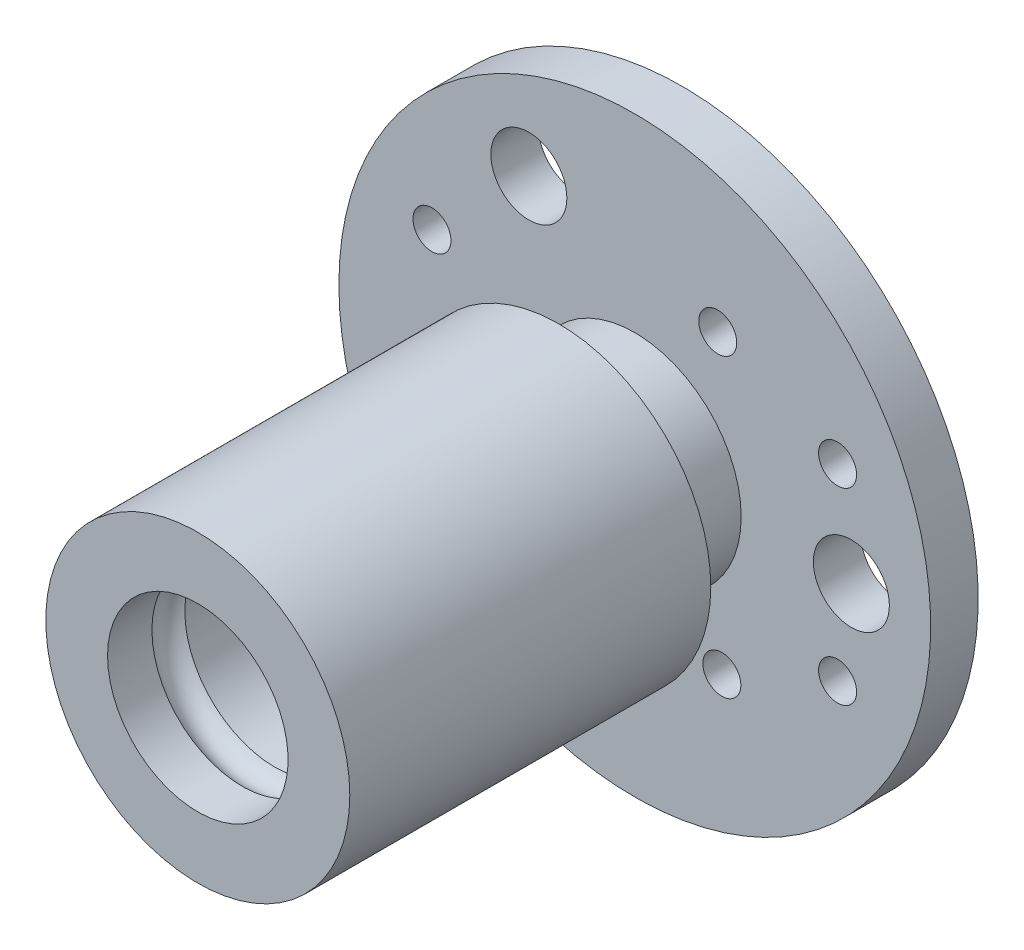
ISO-10303-21;
HEADER;
FILE_DESCRIPTION(('STEP AP214'),'2;1');
FILE_NAME('part.step','',(''),(''),'','','');
FILE_SCHEMA(('AUTOMOTIVE_DESIGN { 1 0 10303 214 1 1 1 1 }'));
ENDSEC;
DATA;
#1=APPLICATION_CONTEXT('core data for automotive mechanical design processes');
#2=APPLICATION_PROTOCOL_DEFINITION('international standard','automotive_design',2000,#1);
#3=PRODUCT_CONTEXT('',#1,'mechanical');
#4=PRODUCT('Part','Part','',(#3));
#5=PRODUCT_RELATED_PRODUCT_CATEGORY('part','',(#4));
#6=PRODUCT_DEFINITION_FORMATION('','',#4);
#7=PRODUCT_DEFINITION_CONTEXT('part definition',#1,'design');
#8=PRODUCT_DEFINITION('design','',#6,#7);
#9=PRODUCT_DEFINITION_SHAPE('','',#8);
#10=(LENGTH_UNIT() NAMED_UNIT(*) SI_UNIT(.MILLI.,.METRE.));
#11=(NAMED_UNIT(*) PLANE_ANGLE_UNIT() SI_UNIT($,.RADIAN.));
#12=(NAMED_UNIT(*) SI_UNIT($,.STERADIAN.) SOLID_ANGLE_UNIT());
#13=UNCERTAINTY_MEASURE_WITH_UNIT(LENGTH_MEASURE(1.E-05),#10,'distance_accuracy_value','');
#14=(GEOMETRIC_REPRESENTATION_CONTEXT(3) GLOBAL_UNCERTAINTY_ASSIGNED_CONTEXT((#13)) GLOBAL_UNIT_ASSIGNED_CONTEXT((#10,
#11,#12)) REPRESENTATION_CONTEXT('',''));
#15=CARTESIAN_POINT('',(0.,0.,0.));
#16=DIRECTION('',(0.,0.,1.));
#17=DIRECTION('',(1.,0.,0.));
#18=AXIS2_PLACEMENT_3D('',#15,#16,#17);
#19=CARTESIAN_POINT('',(0.,0.,51.));
#20=DIRECTION('',(0.,0.,-1.));
#21=DIRECTION('',(-1.,0.,0.));
#22=AXIS2_PLACEMENT_3D('',#19,#20,#21);
#23=CYLINDRICAL_SURFACE('',#22,9.5);
#24=CARTESIAN_POINT('',(0.,0.,42.8679491924311));
#25=DIRECTION('',(0.,0.,1.));
#26=DIRECTION('',(1.,0.,0.));
#27=AXIS2_PLACEMENT_3D('',#24,#25,#26);
#28=CIRCLE('',#27,9.5);
#29=CARTESIAN_POINT('',(9.50000000000001,0.,42.8679491924311));
#30=VERTEX_POINT('',#29);
#31=EDGE_CURVE('E36',#30,#30,#28,.T.);
#32=ORIENTED_EDGE('',*,*,#31,.T.);
#33=EDGE_LOOP('',(#32));
#34=FACE_BOUND('',#33,.T.);
#35=CARTESIAN_POINT('',(0.,0.,0.));
#36=DIRECTION('',(0.,0.,-1.));
#37=DIRECTION('',(-1.,0.,0.));
#38=AXIS2_PLACEMENT_3D('',#35,#36,#37);
#39=CIRCLE('',#38,9.5);
#40=CARTESIAN_POINT('',(-9.5,0.,0.));
#41=VERTEX_POINT('',#40);
#42=EDGE_CURVE('E112',#41,#41,#39,.T.);
#43=ORIENTED_EDGE('',*,*,#42,.T.);
#44=EDGE_LOOP('',(#43));
#45=FACE_BOUND('',#44,.T.);
#46=ADVANCED_FACE('F32',(#34,#45),#23,.F.);
#47=CARTESIAN_POINT('',(0.,0.,5.));
#48=DIRECTION('',(0.,0.,1.));
#49=DIRECTION('',(1.,0.,0.));
#50=AXIS2_PLACEMENT_3D('',#47,#48,#49);
#51=PLANE('',#50);
#52=CARTESIAN_POINT('',(-11.1500000000002,19.8876334956068,5.));
#53=DIRECTION('',(0.,0.,1.));
#54=DIRECTION('',(1.,0.,0.));
#55=AXIS2_PLACEMENT_3D('',#52,#53,#54);
#56=CIRCLE('',#55,4.);
#57=CARTESIAN_POINT('',(-7.15000000000023,19.8876334956068,5.));
#58=VERTEX_POINT('',#57);
#59=EDGE_CURVE('E63',#58,#58,#56,.T.);
#60=ORIENTED_EDGE('',*,*,#59,.F.);
#61=EDGE_LOOP('',(#60));
#62=FACE_BOUND('',#61,.T.);
#63=CARTESIAN_POINT('',(22.79819582835,-0.287633495606848,5.));
#64=DIRECTION('',(0.,0.,1.));
#65=DIRECTION('',(1.,0.,0.));
#66=AXIS2_PLACEMENT_3D('',#63,#64,#65);
#67=CIRCLE('',#66,4.);
#68=CARTESIAN_POINT('',(26.79819582835,-0.287633495606848,5.));
#69=VERTEX_POINT('',#68);
#70=EDGE_CURVE('E52',#69,#69,#67,.T.);
#71=ORIENTED_EDGE('',*,*,#70,.F.);
#72=EDGE_LOOP('',(#71));
#73=FACE_BOUND('',#72,.T.);
#74=CARTESIAN_POINT('',(-11.6481958283499,-19.6,5.));
#75=DIRECTION('',(0.,0.,1.));
#76=DIRECTION('',(1.,0.,0.));
#77=AXIS2_PLACEMENT_3D('',#74,#75,#76);
#78=CIRCLE('',#77,4.);
#79=CARTESIAN_POINT('',(-7.64819582834992,-19.6,5.));
#80=VERTEX_POINT('',#79);
#81=EDGE_CURVE('E67',#80,#80,#78,.F.);
#82=ORIENTED_EDGE('',*,*,#81,.T.);
#83=EDGE_LOOP('',(#82));
#84=FACE_BOUND('',#83,.T.);
#85=CARTESIAN_POINT('',(-21.35,-9.9,5.));
#86=DIRECTION('',(0.,0.,1.));
#87=DIRECTION('',(1.,0.,0.));
#88=AXIS2_PLACEMENT_3D('',#85,#86,#87);
#89=CIRCLE('',#88,2.);
#90=CARTESIAN_POINT('',(-19.35,-9.9,5.));
#91=VERTEX_POINT('',#90);
#92=EDGE_CURVE('E73',#91,#91,#89,.F.);
#93=ORIENTED_EDGE('',*,*,#92,.T.);
#94=EDGE_LOOP('',(#93));
#95=FACE_BOUND('',#94,.T.);
#96=CARTESIAN_POINT('',(-17.8961271989863,-0.248926919069777,5.));
#97=DIRECTION('',(0.,0.,1.));
#98=DIRECTION('',(1.,0.,0.));
#99=AXIS2_PLACEMENT_3D('',#96,#97,#98);
#100=CIRCLE('',#99,2.);
#101=CARTESIAN_POINT('',(-15.8961271989863,-0.248926919069777,5.));
#102=VERTEX_POINT('',#101);
#103=EDGE_CURVE('E81',#102,#102,#100,.F.);
#104=ORIENTED_EDGE('',*,*,#103,.T.);
#105=EDGE_LOOP('',(#104));
#106=FACE_BOUND('',#105,.T.);
#107=CARTESIAN_POINT('',(-21.35,9.9,5.));
#108=DIRECTION('',(0.,0.,1.));
#109=DIRECTION('',(1.,0.,0.));
#110=AXIS2_PLACEMENT_3D('',#107,#108,#109);
#111=CIRCLE('',#110,2.);
#112=CARTESIAN_POINT('',(-19.35,9.9,5.));
#113=VERTEX_POINT('',#112);
#114=EDGE_CURVE('E85',#113,#113,#111,.F.);
#115=ORIENTED_EDGE('',*,*,#114,.T.);
#116=EDGE_LOOP('',(#115));
#117=FACE_BOUND('',#116,.T.);
#118=CARTESIAN_POINT('',(8.73248656389291,15.6229642432146,5.));
#119=DIRECTION('',(0.,0.,1.));
#120=DIRECTION('',(1.,0.,0.));
#121=AXIS2_PLACEMENT_3D('',#118,#119,#120);
#122=CIRCLE('',#121,2.);
#123=CARTESIAN_POINT('',(10.7324865638929,15.6229642432146,5.));
#124=VERTEX_POINT('',#123);
#125=EDGE_CURVE('E93',#124,#124,#122,.F.);
#126=ORIENTED_EDGE('',*,*,#125,.T.);
#127=EDGE_LOOP('',(#126));
#128=FACE_BOUND('',#127,.T.);
#129=CARTESIAN_POINT('',(9.16364063509336,-15.3740373241449,5.));
#130=DIRECTION('',(0.,0.,1.));
#131=DIRECTION('',(1.,0.,0.));
#132=AXIS2_PLACEMENT_3D('',#129,#130,#131);
#133=CIRCLE('',#132,2.);
#134=CARTESIAN_POINT('',(11.1636406350934,-15.3740373241449,5.));
#135=VERTEX_POINT('',#134);
#136=EDGE_CURVE('E99',#135,#135,#133,.F.);
#137=ORIENTED_EDGE('',*,*,#136,.T.);
#138=EDGE_LOOP('',(#137));
#139=FACE_BOUND('',#138,.T.);
#140=CARTESIAN_POINT('',(21.35,-9.90000000000001,5.));
#141=DIRECTION('',(0.,0.,1.));
#142=DIRECTION('',(1.,0.,0.));
#143=AXIS2_PLACEMENT_3D('',#140,#141,#142);
#144=CIRCLE('',#143,2.);
#145=CARTESIAN_POINT('',(23.35,-9.90000000000001,5.));
#146=VERTEX_POINT('',#145);
#147=EDGE_CURVE('E103',#146,#146,#144,.F.);
#148=ORIENTED_EDGE('',*,*,#147,.T.);
#149=EDGE_LOOP('',(#148));
#150=FACE_BOUND('',#149,.T.);
#151=CARTESIAN_POINT('',(21.35,9.9,5.));
#152=DIRECTION('',(0.,0.,1.));
#153=DIRECTION('',(1.,0.,0.));
#154=AXIS2_PLACEMENT_3D('',#151,#152,#153);
#155=CIRCLE('',#154,2.);
#156=CARTESIAN_POINT('',(23.35,9.9,5.));
#157=VERTEX_POINT('',#156);
#158=EDGE_CURVE('E106',#157,#157,#155,.F.);
#159=ORIENTED_EDGE('',*,*,#158,.T.);
#160=EDGE_LOOP('',(#159));
#161=FACE_BOUND('',#160,.T.);
#162=CARTESIAN_POINT('',(0.,0.,5.00000000000002));
#163=DIRECTION('',(0.,0.,-1.));
#164=DIRECTION('',(-1.,0.,0.));
#165=AXIS2_PLACEMENT_3D('',#162,#163,#164);
#166=CIRCLE('',#165,31.15);
#167=CARTESIAN_POINT('',(-31.15,0.,5.00000000000002));
#168=VERTEX_POINT('',#167);
#169=EDGE_CURVE('E308',#168,#168,#166,.F.);
#170=ORIENTED_EDGE('',*,*,#169,.T.);
#171=EDGE_LOOP('',(#170));
#172=FACE_BOUND('',#171,.T.);
#173=CARTESIAN_POINT('',(0.,0.,5.));
#174=DIRECTION('',(0.,0.,1.));
#175=DIRECTION('',(1.,0.,0.));
#176=AXIS2_PLACEMENT_3D('',#173,#174,#175);
#177=CIRCLE('',#176,11.2);
#178=CARTESIAN_POINT('',(11.2,0.,5.));
#179=VERTEX_POINT('',#178);
#180=EDGE_CURVE('E40',#179,#179,#177,.T.);
#181=ORIENTED_EDGE('',*,*,#180,.F.);
#182=EDGE_LOOP('',(#181));
#183=FACE_BOUND('',#182,.T.);
#184=ADVANCED_FACE('F142',(#62,#73,#84,#95,#106,#117,#128,#139,#150,#161,#172,#183),#51,.T.);
#185=CARTESIAN_POINT('',(0.,0.,0.));
#186=DIRECTION('',(0.,0.,1.));
#187=DIRECTION('',(1.,0.,0.));
#188=AXIS2_PLACEMENT_3D('',#185,#186,#187);
#189=PLANE('',#188);
#190=CARTESIAN_POINT('',(-11.1500000000002,19.8876334956068,0.));
#191=DIRECTION('',(0.,0.,-1.));
#192=DIRECTION('',(-1.,0.,0.));
#193=AXIS2_PLACEMENT_3D('',#190,#191,#192);
#194=CIRCLE('',#193,4.);
#195=CARTESIAN_POINT('',(-15.1500000000002,19.8876334956068,0.));
#196=VERTEX_POINT('',#195);
#197=EDGE_CURVE('E314',#196,#196,#194,.T.);
#198=ORIENTED_EDGE('',*,*,#197,.F.);
#199=EDGE_LOOP('',(#198));
#200=FACE_BOUND('',#199,.T.);
#201=CARTESIAN_POINT('',(22.79819582835,-0.287633495606848,0.));
#202=DIRECTION('',(0.,0.,-1.));
#203=DIRECTION('',(-1.,0.,0.));
#204=AXIS2_PLACEMENT_3D('',#201,#202,#203);
#205=CIRCLE('',#204,4.);
#206=CARTESIAN_POINT('',(18.79819582835,-0.287633495606848,0.));
#207=VERTEX_POINT('',#206);
#208=EDGE_CURVE('E58',#207,#207,#205,.T.);
#209=ORIENTED_EDGE('',*,*,#208,.F.);
#210=EDGE_LOOP('',(#209));
#211=FACE_BOUND('',#210,.T.);
#212=CARTESIAN_POINT('',(-11.6481958283499,-19.6,0.));
#213=DIRECTION('',(0.,0.,-1.));
#214=DIRECTION('',(-1.,0.,0.));
#215=AXIS2_PLACEMENT_3D('',#212,#213,#214);
#216=CIRCLE('',#215,4.);
#217=CARTESIAN_POINT('',(-15.6481958283499,-19.6,0.));
#218=VERTEX_POINT('',#217);
#219=EDGE_CURVE('E56',#218,#218,#216,.T.);
#220=ORIENTED_EDGE('',*,*,#219,.F.);
#221=EDGE_LOOP('',(#220));
#222=FACE_BOUND('',#221,.T.);
#223=CARTESIAN_POINT('',(-21.35,-9.9,0.));
#224=DIRECTION('',(0.,0.,-1.));
#225=DIRECTION('',(-1.,0.,0.));
#226=AXIS2_PLACEMENT_3D('',#223,#224,#225);
#227=CIRCLE('',#226,2.);
#228=CARTESIAN_POINT('',(-23.35,-9.9,0.));
#229=VERTEX_POINT('',#228);
#230=EDGE_CURVE('E70',#229,#229,#227,.T.);
#231=ORIENTED_EDGE('',*,*,#230,.F.);
#232=EDGE_LOOP('',(#231));
#233=FACE_BOUND('',#232,.T.);
#234=CARTESIAN_POINT('',(-17.8961271989863,-0.248926919069777,0.));
#235=DIRECTION('',(0.,0.,-1.));
#236=DIRECTION('',(-1.,0.,0.));
#237=AXIS2_PLACEMENT_3D('',#234,#235,#236);
#238=CIRCLE('',#237,2.);
#239=CARTESIAN_POINT('',(-19.8961271989863,-0.248926919069777,0.));
#240=VERTEX_POINT('',#239);
#241=EDGE_CURVE('E76',#240,#240,#238,.T.);
#242=ORIENTED_EDGE('',*,*,#241,.F.);
#243=EDGE_LOOP('',(#242));
#244=FACE_BOUND('',#243,.T.);
#245=CARTESIAN_POINT('',(-21.35,9.9,0.));
#246=DIRECTION('',(0.,0.,-1.));
#247=DIRECTION('',(-1.,0.,0.));
#248=AXIS2_PLACEMENT_3D('',#245,#246,#247);
#249=CIRCLE('',#248,2.);
#250=CARTESIAN_POINT('',(-23.35,9.9,0.));
#251=VERTEX_POINT('',#250);
#252=EDGE_CURVE('E84',#251,#251,#249,.T.);
#253=ORIENTED_EDGE('',*,*,#252,.F.);
#254=EDGE_LOOP('',(#253));
#255=FACE_BOUND('',#254,.T.);
#256=CARTESIAN_POINT('',(8.73248656389291,15.6229642432146,0.));
#257=DIRECTION('',(0.,0.,-1.));
#258=DIRECTION('',(-1.,0.,0.));
#259=AXIS2_PLACEMENT_3D('',#256,#257,#258);
#260=CIRCLE('',#259,2.);
#261=CARTESIAN_POINT('',(6.73248656389291,15.6229642432146,0.));
#262=VERTEX_POINT('',#261);
#263=EDGE_CURVE('E88',#262,#262,#260,.T.);
#264=ORIENTED_EDGE('',*,*,#263,.F.);
#265=EDGE_LOOP('',(#264));
#266=FACE_BOUND('',#265,.T.);
#267=CARTESIAN_POINT('',(9.16364063509336,-15.3740373241449,0.));
#268=DIRECTION('',(0.,0.,-1.));
#269=DIRECTION('',(-1.,0.,0.));
#270=AXIS2_PLACEMENT_3D('',#267,#268,#269);
#271=CIRCLE('',#270,2.);
#272=CARTESIAN_POINT('',(7.16364063509336,-15.3740373241449,0.));
#273=VERTEX_POINT('',#272);
#274=EDGE_CURVE('E96',#273,#273,#271,.T.);
#275=ORIENTED_EDGE('',*,*,#274,.F.);
#276=EDGE_LOOP('',(#275));
#277=FACE_BOUND('',#276,.T.);
#278=CARTESIAN_POINT('',(21.35,-9.90000000000001,0.));
#279=DIRECTION('',(0.,0.,-1.));
#280=DIRECTION('',(-1.,0.,0.));
#281=AXIS2_PLACEMENT_3D('',#278,#279,#280);
#282=CIRCLE('',#281,2.);
#283=CARTESIAN_POINT('',(19.35,-9.90000000000001,0.));
#284=VERTEX_POINT('',#283);
#285=EDGE_CURVE('E102',#284,#284,#282,.T.);
#286=ORIENTED_EDGE('',*,*,#285,.F.);
#287=EDGE_LOOP('',(#286));
#288=FACE_BOUND('',#287,.T.);
#289=CARTESIAN_POINT('',(21.35,9.9,0.));
#290=DIRECTION('',(0.,0.,-1.));
#291=DIRECTION('',(-1.,0.,0.));
#292=AXIS2_PLACEMENT_3D('',#289,#290,#291);
#293=CIRCLE('',#292,2.);
#294=CARTESIAN_POINT('',(19.35,9.9,0.));
#295=VERTEX_POINT('',#294);
#296=EDGE_CURVE('E109',#295,#295,#293,.T.);
#297=ORIENTED_EDGE('',*,*,#296,.F.);
#298=EDGE_LOOP('',(#297));
#299=FACE_BOUND('',#298,.T.);
#300=ORIENTED_EDGE('',*,*,#42,.F.);
#301=EDGE_LOOP('',(#300));
#302=FACE_BOUND('',#301,.T.);
#303=CARTESIAN_POINT('',(0.,0.,0.));
#304=DIRECTION('',(0.,0.,-1.));
#305=DIRECTION('',(-1.,0.,0.));
#306=AXIS2_PLACEMENT_3D('',#303,#304,#305);
#307=CIRCLE('',#306,31.15);
#308=CARTESIAN_POINT('',(-31.15,0.,0.));
#309=VERTEX_POINT('',#308);
#310=EDGE_CURVE('E311',#309,#309,#307,.T.);
#311=ORIENTED_EDGE('',*,*,#310,.T.);
#312=EDGE_LOOP('',(#311));
#313=FACE_BOUND('',#312,.T.);
#314=ADVANCED_FACE('F34',(#200,#211,#222,#233,#244,#255,#266,#277,#288,#299,#302,#313),#189,.F.);
#315=CARTESIAN_POINT('',(0.,0.,13.));
#316=DIRECTION('',(0.,0.,-1.));
#317=DIRECTION('',(-1.,0.,0.));
#318=AXIS2_PLACEMENT_3D('',#315,#316,#317);
#319=CYLINDRICAL_SURFACE('',#318,11.2);
#320=CARTESIAN_POINT('',(0.,0.,13.));
#321=DIRECTION('',(0.,0.,1.));
#322=DIRECTION('',(1.,0.,0.));
#323=AXIS2_PLACEMENT_3D('',#320,#321,#322);
#324=CIRCLE('',#323,11.2);
#325=CARTESIAN_POINT('',(11.2,0.,13.));
#326=VERTEX_POINT('',#325);
#327=EDGE_CURVE('E11',#326,#326,#324,.T.);
#328=ORIENTED_EDGE('',*,*,#327,.F.);
#329=EDGE_LOOP('',(#328));
#330=FACE_BOUND('',#329,.T.);
#331=ORIENTED_EDGE('',*,*,#180,.T.);
#332=EDGE_LOOP('',(#331));
#333=FACE_BOUND('',#332,.T.);
#334=ADVANCED_FACE('F129',(#330,#333),#319,.T.);
#335=CARTESIAN_POINT('',(0.,0.,13.));
#336=DIRECTION('',(0.,0.,1.));
#337=DIRECTION('',(1.,0.,0.));
#338=AXIS2_PLACEMENT_3D('',#335,#336,#337);
#339=PLANE('',#338);
#340=CARTESIAN_POINT('',(0.,0.,13.));
#341=DIRECTION('',(0.,0.,1.));
#342=DIRECTION('',(1.,0.,0.));
#343=AXIS2_PLACEMENT_3D('',#340,#341,#342);
#344=CIRCLE('',#343,16.);
#345=CARTESIAN_POINT('',(16.,0.,13.));
#346=VERTEX_POINT('',#345);
#347=EDGE_CURVE('E48',#346,#346,#344,.T.);
#348=ORIENTED_EDGE('',*,*,#347,.F.);
#349=EDGE_LOOP('',(#348));
#350=FACE_BOUND('',#349,.T.);
#351=ORIENTED_EDGE('',*,*,#327,.T.);
#352=EDGE_LOOP('',(#351));
#353=FACE_BOUND('',#352,.T.);
#354=ADVANCED_FACE('F127',(#350,#353),#339,.F.);
#355=CARTESIAN_POINT('',(0.,0.,51.));
#356=DIRECTION('',(0.,0.,-1.));
#357=DIRECTION('',(-1.,0.,0.));
#358=AXIS2_PLACEMENT_3D('',#355,#356,#357);
#359=CYLINDRICAL_SURFACE('',#358,16.);
#360=CARTESIAN_POINT('',(0.,0.,51.));
#361=DIRECTION('',(0.,0.,1.));
#362=DIRECTION('',(1.,0.,0.));
#363=AXIS2_PLACEMENT_3D('',#360,#361,#362);
#364=CIRCLE('',#363,16.);
#365=CARTESIAN_POINT('',(16.,0.,51.));
#366=VERTEX_POINT('',#365);
#367=EDGE_CURVE('E45',#366,#366,#364,.T.);
#368=ORIENTED_EDGE('',*,*,#367,.F.);
#369=EDGE_LOOP('',(#368));
#370=FACE_BOUND('',#369,.T.);
#371=ORIENTED_EDGE('',*,*,#347,.T.);
#372=EDGE_LOOP('',(#371));
#373=FACE_BOUND('',#372,.T.);
#374=ADVANCED_FACE('F125',(#370,#373),#359,.T.);
#375=CARTESIAN_POINT('',(0.,0.,51.));
#376=DIRECTION('',(0.,0.,1.));
#377=DIRECTION('',(1.,0.,0.));
#378=AXIS2_PLACEMENT_3D('',#375,#376,#377);
#379=PLANE('',#378);
#380=CARTESIAN_POINT('',(0.,0.,51.));
#381=DIRECTION('',(0.,0.,-1.));
#382=DIRECTION('',(-1.,0.,0.));
#383=AXIS2_PLACEMENT_3D('',#380,#381,#382);
#384=CIRCLE('',#383,9.5);
#385=CARTESIAN_POINT('',(-9.5,0.,51.));
#386=VERTEX_POINT('',#385);
#387=EDGE_CURVE('E115',#386,#386,#384,.T.);
#388=ORIENTED_EDGE('',*,*,#387,.T.);
#389=EDGE_LOOP('',(#388));
#390=FACE_BOUND('',#389,.T.);
#391=ORIENTED_EDGE('',*,*,#367,.T.);
#392=EDGE_LOOP('',(#391));
#393=FACE_BOUND('',#392,.T.);
#394=ADVANCED_FACE('F135',(#390,#393),#379,.T.);
#395=CARTESIAN_POINT('',(0.,0.,46.3320508075689));
#396=DIRECTION('',(0.,0.,-1.));
#397=DIRECTION('',(-1.,0.,0.));
#398=AXIS2_PLACEMENT_3D('',#395,#396,#397);
#399=CIRCLE('',#398,9.5);
#400=CARTESIAN_POINT('',(-9.5,0.,46.3320508075689));
#401=VERTEX_POINT('',#400);
#402=EDGE_CURVE('E50',#401,#401,#399,.T.);
#403=ORIENTED_EDGE('',*,*,#402,.T.);
#404=EDGE_LOOP('',(#403));
#405=FACE_BOUND('',#404,.T.);
#406=ORIENTED_EDGE('',*,*,#387,.F.);
#407=EDGE_LOOP('',(#406));
#408=FACE_BOUND('',#407,.T.);
#409=ADVANCED_FACE('F145',(#405,#408),#23,.F.);
#410=CARTESIAN_POINT('',(21.35,9.9,51.001));
#411=DIRECTION('',(0.,0.,-1.));
#412=DIRECTION('',(-1.,0.,0.));
#413=AXIS2_PLACEMENT_3D('',#410,#411,#412);
#414=CYLINDRICAL_SURFACE('',#413,2.);
#415=ORIENTED_EDGE('',*,*,#158,.F.);
#416=EDGE_LOOP('',(#415));
#417=FACE_BOUND('',#416,.T.);
#418=ORIENTED_EDGE('',*,*,#296,.T.);
#419=EDGE_LOOP('',(#418));
#420=FACE_BOUND('',#419,.T.);
#421=ADVANCED_FACE('F153',(#417,#420),#414,.F.);
#422=CARTESIAN_POINT('',(21.35,-9.90000000000001,51.001));
#423=DIRECTION('',(0.,0.,-1.));
#424=DIRECTION('',(-1.,0.,0.));
#425=AXIS2_PLACEMENT_3D('',#422,#423,#424);
#426=CYLINDRICAL_SURFACE('',#425,2.);
#427=ORIENTED_EDGE('',*,*,#147,.F.);
#428=EDGE_LOOP('',(#427));
#429=FACE_BOUND('',#428,.T.);
#430=ORIENTED_EDGE('',*,*,#285,.T.);
#431=EDGE_LOOP('',(#430));
#432=FACE_BOUND('',#431,.T.);
#433=ADVANCED_FACE('F158',(#429,#432),#426,.F.);
#434=CARTESIAN_POINT('',(9.16364063509336,-15.3740373241449,51.001));
#435=DIRECTION('',(0.,0.,-1.));
#436=DIRECTION('',(-1.,0.,0.));
#437=AXIS2_PLACEMENT_3D('',#434,#435,#436);
#438=CYLINDRICAL_SURFACE('',#437,2.);
#439=ORIENTED_EDGE('',*,*,#136,.F.);
#440=EDGE_LOOP('',(#439));
#441=FACE_BOUND('',#440,.T.);
#442=ORIENTED_EDGE('',*,*,#274,.T.);
#443=EDGE_LOOP('',(#442));
#444=FACE_BOUND('',#443,.T.);
#445=ADVANCED_FACE('F265',(#441,#444),#438,.F.);
#446=CARTESIAN_POINT('',(8.73248656389291,15.6229642432146,51.001));
#447=DIRECTION('',(0.,0.,-1.));
#448=DIRECTION('',(-1.,0.,0.));
#449=AXIS2_PLACEMENT_3D('',#446,#447,#448);
#450=CYLINDRICAL_SURFACE('',#449,2.);
#451=ORIENTED_EDGE('',*,*,#125,.F.);
#452=EDGE_LOOP('',(#451));
#453=FACE_BOUND('',#452,.T.);
#454=ORIENTED_EDGE('',*,*,#263,.T.);
#455=EDGE_LOOP('',(#454));
#456=FACE_BOUND('',#455,.T.);
#457=ADVANCED_FACE('F255',(#453,#456),#450,.F.);
#458=CARTESIAN_POINT('',(-21.35,9.9,51.001));
#459=DIRECTION('',(0.,0.,-1.));
#460=DIRECTION('',(-1.,0.,0.));
#461=AXIS2_PLACEMENT_3D('',#458,#459,#460);
#462=CYLINDRICAL_SURFACE('',#461,2.);
#463=ORIENTED_EDGE('',*,*,#114,.F.);
#464=EDGE_LOOP('',(#463));
#465=FACE_BOUND('',#464,.T.);
#466=ORIENTED_EDGE('',*,*,#252,.T.);
#467=EDGE_LOOP('',(#466));
#468=FACE_BOUND('',#467,.T.);
#469=ADVANCED_FACE('F245',(#465,#468),#462,.F.);
#470=CARTESIAN_POINT('',(-17.8961271989863,-0.248926919069777,51.001));
#471=DIRECTION('',(0.,0.,-1.));
#472=DIRECTION('',(-1.,0.,0.));
#473=AXIS2_PLACEMENT_3D('',#470,#471,#472);
#474=CYLINDRICAL_SURFACE('',#473,2.);
#475=ORIENTED_EDGE('',*,*,#103,.F.);
#476=EDGE_LOOP('',(#475));
#477=FACE_BOUND('',#476,.T.);
#478=ORIENTED_EDGE('',*,*,#241,.T.);
#479=EDGE_LOOP('',(#478));
#480=FACE_BOUND('',#479,.T.);
#481=ADVANCED_FACE('F235',(#477,#480),#474,.F.);
#482=CARTESIAN_POINT('',(-21.35,-9.9,51.001));
#483=DIRECTION('',(0.,0.,-1.));
#484=DIRECTION('',(-1.,0.,0.));
#485=AXIS2_PLACEMENT_3D('',#482,#483,#484);
#486=CYLINDRICAL_SURFACE('',#485,2.);
#487=ORIENTED_EDGE('',*,*,#92,.F.);
#488=EDGE_LOOP('',(#487));
#489=FACE_BOUND('',#488,.T.);
#490=ORIENTED_EDGE('',*,*,#230,.T.);
#491=EDGE_LOOP('',(#490));
#492=FACE_BOUND('',#491,.T.);
#493=ADVANCED_FACE('F225',(#489,#492),#486,.F.);
#494=CARTESIAN_POINT('',(-11.6481958283499,-19.6,51.001));
#495=DIRECTION('',(0.,0.,-1.));
#496=DIRECTION('',(-1.,0.,0.));
#497=AXIS2_PLACEMENT_3D('',#494,#495,#496);
#498=CYLINDRICAL_SURFACE('',#497,4.);
#499=ORIENTED_EDGE('',*,*,#81,.F.);
#500=EDGE_LOOP('',(#499));
#501=FACE_BOUND('',#500,.T.);
#502=ORIENTED_EDGE('',*,*,#219,.T.);
#503=EDGE_LOOP('',(#502));
#504=FACE_BOUND('',#503,.T.);
#505=ADVANCED_FACE('F203',(#501,#504),#498,.F.);
#506=CARTESIAN_POINT('',(0.,0.,44.6));
#507=DIRECTION('',(0.,0.,-1.));
#508=DIRECTION('',(-1.,0.,0.));
#509=AXIS2_PLACEMENT_3D('',#506,#507,#508);
#510=TOROIDAL_SURFACE('',#509,8.50000000000001,2.);
#511=ORIENTED_EDGE('',*,*,#402,.F.);
#512=EDGE_LOOP('',(#511));
#513=FACE_BOUND('',#512,.T.);
#514=ORIENTED_EDGE('',*,*,#31,.F.);
#515=EDGE_LOOP('',(#514));
#516=FACE_BOUND('',#515,.T.);
#517=ADVANCED_FACE('F198',(#513,#516),#510,.F.);
#518=CARTESIAN_POINT('',(22.79819582835,-0.287633495606848,10.));
#519=DIRECTION('',(0.,0.,-1.));
#520=DIRECTION('',(-1.,0.,0.));
#521=AXIS2_PLACEMENT_3D('',#518,#519,#520);
#522=CYLINDRICAL_SURFACE('',#521,4.);
#523=ORIENTED_EDGE('',*,*,#70,.T.);
#524=EDGE_LOOP('',(#523));
#525=FACE_BOUND('',#524,.T.);
#526=ORIENTED_EDGE('',*,*,#208,.T.);
#527=EDGE_LOOP('',(#526));
#528=FACE_BOUND('',#527,.T.);
#529=ADVANCED_FACE('F202',(#525,#528),#522,.F.);
#530=CARTESIAN_POINT('',(-11.1500000000002,19.8876334956068,10.));
#531=DIRECTION('',(0.,0.,-1.));
#532=DIRECTION('',(-1.,0.,0.));
#533=AXIS2_PLACEMENT_3D('',#530,#531,#532);
#534=CYLINDRICAL_SURFACE('',#533,4.);
#535=ORIENTED_EDGE('',*,*,#59,.T.);
#536=EDGE_LOOP('',(#535));
#537=FACE_BOUND('',#536,.T.);
#538=ORIENTED_EDGE('',*,*,#197,.T.);
#539=EDGE_LOOP('',(#538));
#540=FACE_BOUND('',#539,.T.);
#541=ADVANCED_FACE('F296',(#537,#540),#534,.F.);
#542=CARTESIAN_POINT('',(0.,0.,10.));
#543=DIRECTION('',(0.,0.,-1.));
#544=DIRECTION('',(-1.,0.,0.));
#545=AXIS2_PLACEMENT_3D('',#542,#543,#544);
#546=CYLINDRICAL_SURFACE('',#545,31.15);
#547=ORIENTED_EDGE('',*,*,#169,.F.);
#548=EDGE_LOOP('',(#547));
#549=FACE_BOUND('',#548,.T.);
#550=ORIENTED_EDGE('',*,*,#310,.F.);
#551=EDGE_LOOP('',(#550));
#552=FACE_BOUND('',#551,.T.);
#553=ADVANCED_FACE('F299',(#549,#552),#546,.T.);
#554=CLOSED_SHELL('',(#46,#184,#314,#334,#354,#374,#394,#409,#421,#433,#445,#457,#469,#481,#493,
#505,#517,#529,#541,#553));
#555=MANIFOLD_SOLID_BREP('B2',#554);
#556=ADVANCED_BREP_SHAPE_REPRESENTATION('',(#18,#555),#14);
#557=SHAPE_DEFINITION_REPRESENTATION(#9,#556);
ENDSEC;
END-ISO-10303-21;
